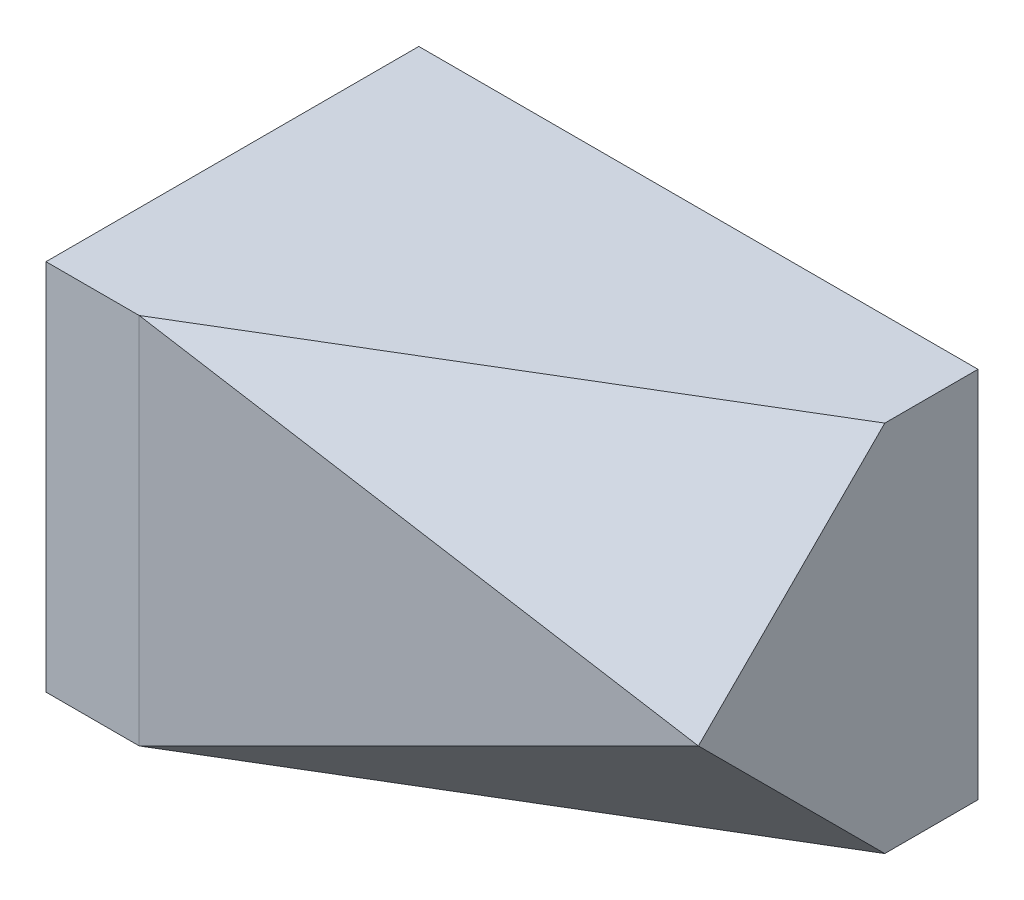
ISO-10303-21;
HEADER;
FILE_DESCRIPTION(('STEP AP214'),'2;1');
FILE_NAME('part.step','',(''),(''),'','','');
FILE_SCHEMA(('AUTOMOTIVE_DESIGN { 1 0 10303 214 1 1 1 1 }'));
ENDSEC;
DATA;
#1=APPLICATION_CONTEXT('core data for automotive mechanical design processes');
#2=APPLICATION_PROTOCOL_DEFINITION('international standard','automotive_design',2000,#1);
#3=PRODUCT_CONTEXT('',#1,'mechanical');
#4=PRODUCT('Part','Part','',(#3));
#5=PRODUCT_RELATED_PRODUCT_CATEGORY('part','',(#4));
#6=PRODUCT_DEFINITION_FORMATION('','',#4);
#7=PRODUCT_DEFINITION_CONTEXT('part definition',#1,'design');
#8=PRODUCT_DEFINITION('design','',#6,#7);
#9=PRODUCT_DEFINITION_SHAPE('','',#8);
#10=(LENGTH_UNIT() NAMED_UNIT(*) SI_UNIT(.MILLI.,.METRE.));
#11=(NAMED_UNIT(*) PLANE_ANGLE_UNIT() SI_UNIT($,.RADIAN.));
#12=(NAMED_UNIT(*) SI_UNIT($,.STERADIAN.) SOLID_ANGLE_UNIT());
#13=UNCERTAINTY_MEASURE_WITH_UNIT(LENGTH_MEASURE(1.E-05),#10,'distance_accuracy_value','');
#14=(GEOMETRIC_REPRESENTATION_CONTEXT(3) GLOBAL_UNCERTAINTY_ASSIGNED_CONTEXT((#13)) GLOBAL_UNIT_ASSIGNED_CONTEXT((#10,
#11,#12)) REPRESENTATION_CONTEXT('',''));
#15=CARTESIAN_POINT('',(0.,0.,0.));
#16=DIRECTION('',(0.,0.,1.));
#17=DIRECTION('',(1.,0.,0.));
#18=AXIS2_PLACEMENT_3D('',#15,#16,#17);
#19=CARTESIAN_POINT('',(1.73949579831933,12.,-0.0924369747899148));
#20=DIRECTION('',(-0.196116135138184,0.,-0.98058067569092));
#21=DIRECTION('',(-0.98058067569092,0.,0.196116135138184));
#22=AXIS2_PLACEMENT_3D('',#19,#20,#21);
#23=PLANE('',#22);
#24=DIRECTION('',(-0.912870929175277,-0.365148371670111,0.182574185835056));
#25=VECTOR('',#24,1.);
#26=CARTESIAN_POINT('',(2.406162464986,10.2666666666667,-0.225770308123248));
#27=LINE('',#26,#25);
#28=CARTESIAN_POINT('',(1.73949579831933,10.,-0.0924369747899141));
#29=VERTEX_POINT('',#28);
#30=CARTESIAN_POINT('',(-3.26050420168067,8.,0.907563025210086));
#31=VERTEX_POINT('',#30);
#32=EDGE_CURVE('E99',#29,#31,#27,.T.);
#33=ORIENTED_EDGE('',*,*,#32,.F.);
#34=DIRECTION('',(-0.912870929175277,0.365148371670111,0.182574185835055));
#35=VECTOR('',#34,1.);
#36=CARTESIAN_POINT('',(1.07282913165267,10.2666666666667,0.0408963585434184));
#37=LINE('',#36,#35);
#38=CARTESIAN_POINT('',(-3.26050420168067,12.,0.907563025210086));
#39=VERTEX_POINT('',#38);
#40=EDGE_CURVE('E108',#29,#39,#37,.T.);
#41=ORIENTED_EDGE('',*,*,#40,.T.);
#42=DIRECTION('',(0.,-1.,0.));
#43=VECTOR('',#42,1.);
#44=CARTESIAN_POINT('',(-3.26050420168067,12.,0.907563025210086));
#45=LINE('',#44,#43);
#46=EDGE_CURVE('E109',#39,#31,#45,.T.);
#47=ORIENTED_EDGE('',*,*,#46,.T.);
#48=EDGE_LOOP('',(#33,#41,#47));
#49=FACE_BOUND('',#48,.T.);
#50=ADVANCED_FACE('F36',(#49),#23,.F.);
#51=CARTESIAN_POINT('',(1.73949579831933,12.,-3.09243697478992));
#52=DIRECTION('',(-1.,0.,0.));
#53=DIRECTION('',(0.,0.,1.));
#54=AXIS2_PLACEMENT_3D('',#51,#52,#53);
#55=PLANE('',#54);
#56=DIRECTION('',(0.,0.707106781186548,0.707106781186548));
#57=VECTOR('',#56,1.);
#58=CARTESIAN_POINT('',(1.73949579831933,9.5,-0.592436974789915));
#59=LINE('',#58,#57);
#60=CARTESIAN_POINT('',(1.73949579831933,8.,-2.09243697478991));
#61=VERTEX_POINT('',#60);
#62=EDGE_CURVE('E96',#61,#29,#59,.T.);
#63=ORIENTED_EDGE('',*,*,#62,.F.);
#64=DIRECTION('',(0.,0.,-1.));
#65=VECTOR('',#64,1.);
#66=CARTESIAN_POINT('',(1.73949579831933,8.,-3.09243697478992));
#67=LINE('',#66,#65);
#68=CARTESIAN_POINT('',(1.73949579831933,8.,-3.09243697478992));
#69=VERTEX_POINT('',#68);
#70=EDGE_CURVE('E131',#61,#69,#67,.T.);
#71=ORIENTED_EDGE('',*,*,#70,.T.);
#72=DIRECTION('',(0.,-1.,0.));
#73=VECTOR('',#72,1.);
#74=CARTESIAN_POINT('',(1.73949579831933,12.,-3.09243697478992));
#75=LINE('',#74,#73);
#76=CARTESIAN_POINT('',(1.73949579831933,12.,-3.09243697478992));
#77=VERTEX_POINT('',#76);
#78=EDGE_CURVE('E135',#77,#69,#75,.T.);
#79=ORIENTED_EDGE('',*,*,#78,.F.);
#80=DIRECTION('',(0.,0.,-1.));
#81=VECTOR('',#80,1.);
#82=CARTESIAN_POINT('',(1.73949579831933,12.,-3.09243697478992));
#83=LINE('',#82,#81);
#84=CARTESIAN_POINT('',(1.73949579831933,12.,-2.09243697478991));
#85=VERTEX_POINT('',#84);
#86=EDGE_CURVE('E117',#85,#77,#83,.T.);
#87=ORIENTED_EDGE('',*,*,#86,.F.);
#88=DIRECTION('',(0.,-0.707106781186548,0.707106781186547));
#89=VECTOR('',#88,1.);
#90=CARTESIAN_POINT('',(1.73949579831933,12.5,-2.59243697478991));
#91=LINE('',#90,#89);
#92=EDGE_CURVE('E51',#85,#29,#91,.T.);
#93=ORIENTED_EDGE('',*,*,#92,.T.);
#94=EDGE_LOOP('',(#63,#71,#79,#87,#93));
#95=FACE_BOUND('',#94,.T.);
#96=ADVANCED_FACE('F115',(#95),#55,.F.);
#97=CARTESIAN_POINT('',(-1.26050420168067,8.,-1.09243697478991));
#98=DIRECTION('',(0.,-1.,0.));
#99=DIRECTION('',(0.,0.,-1.));
#100=AXIS2_PLACEMENT_3D('',#97,#98,#99);
#101=PLANE('',#100);
#102=ORIENTED_EDGE('',*,*,#70,.F.);
#103=DIRECTION('',(-0.857492925712544,0.,0.514495755427527));
#104=VECTOR('',#103,1.);
#105=CARTESIAN_POINT('',(-0.907563025210081,8.,-0.504201680672267));
#106=LINE('',#105,#104);
#107=EDGE_CURVE('E101',#61,#31,#106,.T.);
#108=ORIENTED_EDGE('',*,*,#107,.T.);
#109=DIRECTION('',(1.,0.,0.));
#110=VECTOR('',#109,1.);
#111=CARTESIAN_POINT('',(-3.26050420168067,8.,0.907563025210086));
#112=LINE('',#111,#110);
#113=CARTESIAN_POINT('',(-4.26050420168067,8.,0.907563025210086));
#114=VERTEX_POINT('',#113);
#115=EDGE_CURVE('E128',#114,#31,#112,.T.);
#116=ORIENTED_EDGE('',*,*,#115,.F.);
#117=DIRECTION('',(0.,0.,1.));
#118=VECTOR('',#117,1.);
#119=CARTESIAN_POINT('',(-4.26050420168067,8.,-3.09243697478991));
#120=LINE('',#119,#118);
#121=CARTESIAN_POINT('',(-4.26050420168067,8.,-3.09243697478991));
#122=VERTEX_POINT('',#121);
#123=EDGE_CURVE('E112',#122,#114,#120,.T.);
#124=ORIENTED_EDGE('',*,*,#123,.F.);
#125=DIRECTION('',(-1.,0.,0.));
#126=VECTOR('',#125,1.);
#127=CARTESIAN_POINT('',(1.73949579831933,8.,-3.09243697478992));
#128=LINE('',#127,#126);
#129=EDGE_CURVE('E79',#69,#122,#128,.T.);
#130=ORIENTED_EDGE('',*,*,#129,.F.);
#131=EDGE_LOOP('',(#102,#108,#116,#124,#130));
#132=FACE_BOUND('',#131,.T.);
#133=ADVANCED_FACE('F143',(#132),#101,.T.);
#134=CARTESIAN_POINT('',(-4.26050420168067,12.,-3.09243697478991));
#135=DIRECTION('',(1.,0.,0.));
#136=DIRECTION('',(0.,0.,-1.));
#137=AXIS2_PLACEMENT_3D('',#134,#135,#136);
#138=PLANE('',#137);
#139=ORIENTED_EDGE('',*,*,#123,.T.);
#140=DIRECTION('',(0.,-1.,0.));
#141=VECTOR('',#140,1.);
#142=CARTESIAN_POINT('',(-4.26050420168067,12.,0.907563025210086));
#143=LINE('',#142,#141);
#144=CARTESIAN_POINT('',(-4.26050420168067,12.,0.907563025210086));
#145=VERTEX_POINT('',#144);
#146=EDGE_CURVE('E44',#145,#114,#143,.T.);
#147=ORIENTED_EDGE('',*,*,#146,.F.);
#148=DIRECTION('',(0.,0.,1.));
#149=VECTOR('',#148,1.);
#150=CARTESIAN_POINT('',(-4.26050420168067,12.,-3.09243697478991));
#151=LINE('',#150,#149);
#152=CARTESIAN_POINT('',(-4.26050420168067,12.,-3.09243697478991));
#153=VERTEX_POINT('',#152);
#154=EDGE_CURVE('E120',#153,#145,#151,.T.);
#155=ORIENTED_EDGE('',*,*,#154,.F.);
#156=DIRECTION('',(0.,-1.,0.));
#157=VECTOR('',#156,1.);
#158=CARTESIAN_POINT('',(-4.26050420168067,12.,-3.09243697478991));
#159=LINE('',#158,#157);
#160=EDGE_CURVE('E125',#153,#122,#159,.T.);
#161=ORIENTED_EDGE('',*,*,#160,.T.);
#162=EDGE_LOOP('',(#139,#147,#155,#161));
#163=FACE_BOUND('',#162,.T.);
#164=ADVANCED_FACE('F38',(#163),#138,.F.);
#165=CARTESIAN_POINT('',(-3.26050420168067,12.,0.907563025210086));
#166=DIRECTION('',(0.,0.,-1.));
#167=DIRECTION('',(-1.,0.,0.));
#168=AXIS2_PLACEMENT_3D('',#165,#166,#167);
#169=PLANE('',#168);
#170=ORIENTED_EDGE('',*,*,#115,.T.);
#171=ORIENTED_EDGE('',*,*,#46,.F.);
#172=DIRECTION('',(1.,0.,0.));
#173=VECTOR('',#172,1.);
#174=CARTESIAN_POINT('',(-3.26050420168067,12.,0.907563025210086));
#175=LINE('',#174,#173);
#176=EDGE_CURVE('E86',#145,#39,#175,.T.);
#177=ORIENTED_EDGE('',*,*,#176,.F.);
#178=ORIENTED_EDGE('',*,*,#146,.T.);
#179=EDGE_LOOP('',(#170,#171,#177,#178));
#180=FACE_BOUND('',#179,.T.);
#181=ADVANCED_FACE('F138',(#180),#169,.F.);
#182=CARTESIAN_POINT('',(1.73949579831933,12.,-3.09243697478992));
#183=DIRECTION('',(0.,0.,1.));
#184=DIRECTION('',(1.,0.,0.));
#185=AXIS2_PLACEMENT_3D('',#182,#183,#184);
#186=PLANE('',#185);
#187=ORIENTED_EDGE('',*,*,#129,.T.);
#188=ORIENTED_EDGE('',*,*,#160,.F.);
#189=DIRECTION('',(-1.,0.,0.));
#190=VECTOR('',#189,1.);
#191=CARTESIAN_POINT('',(1.73949579831933,12.,-3.09243697478992));
#192=LINE('',#191,#190);
#193=EDGE_CURVE('E59',#77,#153,#192,.T.);
#194=ORIENTED_EDGE('',*,*,#193,.F.);
#195=ORIENTED_EDGE('',*,*,#78,.T.);
#196=EDGE_LOOP('',(#187,#188,#194,#195));
#197=FACE_BOUND('',#196,.T.);
#198=ADVANCED_FACE('F145',(#197),#186,.F.);
#199=CARTESIAN_POINT('',(-1.26050420168067,12.,-1.09243697478991));
#200=DIRECTION('',(0.,-1.,0.));
#201=DIRECTION('',(0.,0.,-1.));
#202=AXIS2_PLACEMENT_3D('',#199,#200,#201);
#203=PLANE('',#202);
#204=ORIENTED_EDGE('',*,*,#176,.T.);
#205=DIRECTION('',(0.857492925712544,0.,-0.514495755427526));
#206=VECTOR('',#205,1.);
#207=CARTESIAN_POINT('',(-0.90756302521008,12.,-0.504201680672265));
#208=LINE('',#207,#206);
#209=EDGE_CURVE('E11',#39,#85,#208,.T.);
#210=ORIENTED_EDGE('',*,*,#209,.T.);
#211=ORIENTED_EDGE('',*,*,#86,.T.);
#212=ORIENTED_EDGE('',*,*,#193,.T.);
#213=ORIENTED_EDGE('',*,*,#154,.T.);
#214=EDGE_LOOP('',(#204,#210,#211,#212,#213));
#215=FACE_BOUND('',#214,.T.);
#216=ADVANCED_FACE('F146',(#215),#203,.F.);
#217=CARTESIAN_POINT('',(-0.0401652186298214,10.0338983050847,0.941461330294832));
#218=DIRECTION('',(-0.390566732942472,-0.650944554904119,-0.65094455490412));
#219=DIRECTION('',(0.,0.707106781186548,-0.707106781186547));
#220=AXIS2_PLACEMENT_3D('',#217,#218,#219);
#221=PLANE('',#220);
#222=ORIENTED_EDGE('',*,*,#92,.F.);
#223=ORIENTED_EDGE('',*,*,#209,.F.);
#224=ORIENTED_EDGE('',*,*,#40,.F.);
#225=EDGE_LOOP('',(#222,#223,#224));
#226=FACE_BOUND('',#225,.T.);
#227=ADVANCED_FACE('F111',(#226),#221,.F.);
#228=CARTESIAN_POINT('',(-1.05711437117219,7.66101694915254,-0.753453923942457));
#229=DIRECTION('',(0.390566732942472,-0.650944554904119,0.650944554904119));
#230=DIRECTION('',(0.,-0.707106781186548,-0.707106781186548));
#231=AXIS2_PLACEMENT_3D('',#228,#229,#230);
#232=PLANE('',#231);
#233=ORIENTED_EDGE('',*,*,#32,.T.);
#234=ORIENTED_EDGE('',*,*,#107,.F.);
#235=ORIENTED_EDGE('',*,*,#62,.T.);
#236=EDGE_LOOP('',(#233,#234,#235));
#237=FACE_BOUND('',#236,.T.);
#238=ADVANCED_FACE('F98',(#237),#232,.T.);
#239=CLOSED_SHELL('',(#50,#96,#133,#164,#181,#198,#216,#227,#238));
#240=MANIFOLD_SOLID_BREP('B2',#239);
#241=ADVANCED_BREP_SHAPE_REPRESENTATION('',(#18,#240),#14);
#242=SHAPE_DEFINITION_REPRESENTATION(#9,#241);
ENDSEC;
END-ISO-10303-21;
